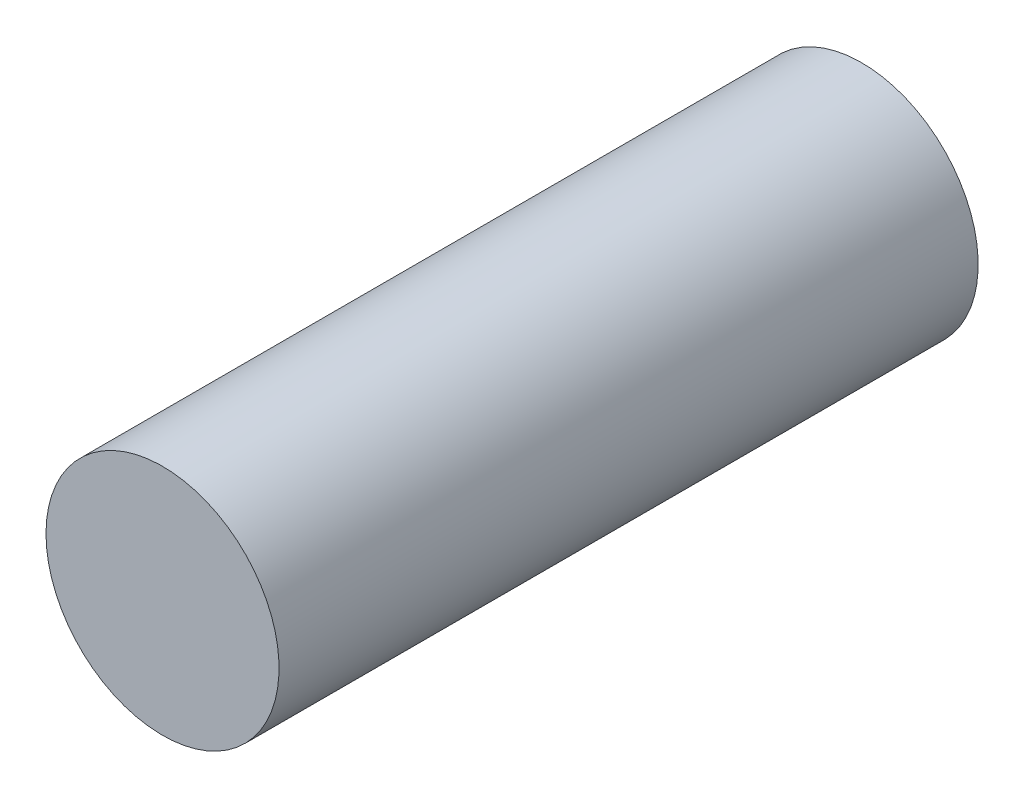
ISO-10303-21;
HEADER;
FILE_DESCRIPTION(('STEP AP214'),'2;1');
FILE_NAME('part.step','',(''),(''),'','','');
FILE_SCHEMA(('AUTOMOTIVE_DESIGN { 1 0 10303 214 1 1 1 1 }'));
ENDSEC;
DATA;
#1=APPLICATION_CONTEXT('core data for automotive mechanical design processes');
#2=APPLICATION_PROTOCOL_DEFINITION('international standard','automotive_design',2000,#1);
#3=PRODUCT_CONTEXT('',#1,'mechanical');
#4=PRODUCT('Part','Part','',(#3));
#5=PRODUCT_RELATED_PRODUCT_CATEGORY('part','',(#4));
#6=PRODUCT_DEFINITION_FORMATION('','',#4);
#7=PRODUCT_DEFINITION_CONTEXT('part definition',#1,'design');
#8=PRODUCT_DEFINITION('design','',#6,#7);
#9=PRODUCT_DEFINITION_SHAPE('','',#8);
#10=(LENGTH_UNIT() NAMED_UNIT(*) SI_UNIT(.MILLI.,.METRE.));
#11=(NAMED_UNIT(*) PLANE_ANGLE_UNIT() SI_UNIT($,.RADIAN.));
#12=(NAMED_UNIT(*) SI_UNIT($,.STERADIAN.) SOLID_ANGLE_UNIT());
#13=UNCERTAINTY_MEASURE_WITH_UNIT(LENGTH_MEASURE(1.E-05),#10,'distance_accuracy_value','');
#14=(GEOMETRIC_REPRESENTATION_CONTEXT(3) GLOBAL_UNCERTAINTY_ASSIGNED_CONTEXT((#13)) GLOBAL_UNIT_ASSIGNED_CONTEXT((#10,
#11,#12)) REPRESENTATION_CONTEXT('',''));
#15=CARTESIAN_POINT('',(0.,0.,0.));
#16=DIRECTION('',(0.,0.,1.));
#17=DIRECTION('',(1.,0.,0.));
#18=AXIS2_PLACEMENT_3D('',#15,#16,#17);
#19=CARTESIAN_POINT('',(0.,0.,9.525));
#20=DIRECTION('',(0.,0.,1.));
#21=DIRECTION('',(1.,0.,0.));
#22=AXIS2_PLACEMENT_3D('',#19,#20,#21);
#23=PLANE('',#22);
#24=CARTESIAN_POINT('',(0.,0.,9.525));
#25=DIRECTION('',(0.,0.,-1.));
#26=DIRECTION('',(-1.,0.,0.));
#27=AXIS2_PLACEMENT_3D('',#24,#25,#26);
#28=CIRCLE('',#27,3.175);
#29=CARTESIAN_POINT('',(-3.175,0.,9.525));
#30=VERTEX_POINT('',#29);
#31=EDGE_CURVE('E19',#30,#30,#28,.T.);
#32=ORIENTED_EDGE('',*,*,#31,.F.);
#33=EDGE_LOOP('',(#32));
#34=FACE_BOUND('',#33,.T.);
#35=ADVANCED_FACE('F16',(#34),#23,.T.);
#36=CARTESIAN_POINT('',(0.,0.,-9.525));
#37=DIRECTION('',(0.,0.,1.));
#38=DIRECTION('',(1.,0.,0.));
#39=AXIS2_PLACEMENT_3D('',#36,#37,#38);
#40=PLANE('',#39);
#41=CARTESIAN_POINT('',(0.,0.,-9.525));
#42=DIRECTION('',(0.,0.,-1.));
#43=DIRECTION('',(-1.,0.,0.));
#44=AXIS2_PLACEMENT_3D('',#41,#42,#43);
#45=CIRCLE('',#44,3.175);
#46=CARTESIAN_POINT('',(-3.175,0.,-9.525));
#47=VERTEX_POINT('',#46);
#48=EDGE_CURVE('E10',#47,#47,#45,.F.);
#49=ORIENTED_EDGE('',*,*,#48,.F.);
#50=EDGE_LOOP('',(#49));
#51=FACE_BOUND('',#50,.T.);
#52=ADVANCED_FACE('F31',(#51),#40,.F.);
#53=CARTESIAN_POINT('',(0.,0.,9.525));
#54=DIRECTION('',(0.,0.,-1.));
#55=DIRECTION('',(-1.,0.,0.));
#56=AXIS2_PLACEMENT_3D('',#53,#54,#55);
#57=CYLINDRICAL_SURFACE('',#56,3.175);
#58=ORIENTED_EDGE('',*,*,#48,.T.);
#59=EDGE_LOOP('',(#58));
#60=FACE_BOUND('',#59,.T.);
#61=ORIENTED_EDGE('',*,*,#31,.T.);
#62=EDGE_LOOP('',(#61));
#63=FACE_BOUND('',#62,.T.);
#64=ADVANCED_FACE('F28',(#60,#63),#57,.T.);
#65=CLOSED_SHELL('',(#35,#52,#64));
#66=MANIFOLD_SOLID_BREP('B1',#65);
#67=ADVANCED_BREP_SHAPE_REPRESENTATION('',(#18,#66),#14);
#68=SHAPE_DEFINITION_REPRESENTATION(#9,#67);
ENDSEC;
END-ISO-10303-21;
